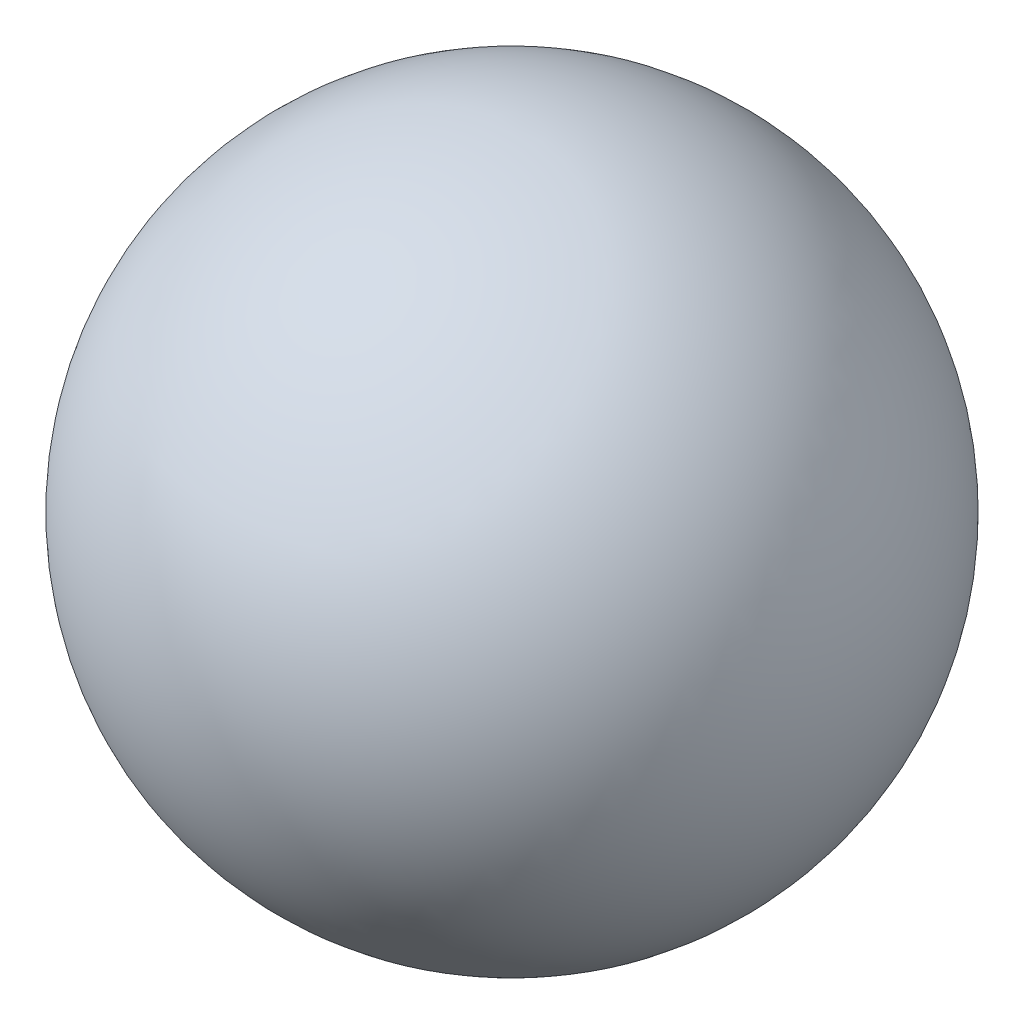
ISO-10303-21;
HEADER;
FILE_DESCRIPTION(('STEP AP214'),'2;1');
FILE_NAME('part.step','',(''),(''),'','','');
FILE_SCHEMA(('AUTOMOTIVE_DESIGN { 1 0 10303 214 1 1 1 1 }'));
ENDSEC;
DATA;
#1=APPLICATION_CONTEXT('core data for automotive mechanical design processes');
#2=APPLICATION_PROTOCOL_DEFINITION('international standard','automotive_design',2000,#1);
#3=PRODUCT_CONTEXT('',#1,'mechanical');
#4=PRODUCT('Part','Part','',(#3));
#5=PRODUCT_RELATED_PRODUCT_CATEGORY('part','',(#4));
#6=PRODUCT_DEFINITION_FORMATION('','',#4);
#7=PRODUCT_DEFINITION_CONTEXT('part definition',#1,'design');
#8=PRODUCT_DEFINITION('design','',#6,#7);
#9=PRODUCT_DEFINITION_SHAPE('','',#8);
#10=(LENGTH_UNIT() NAMED_UNIT(*) SI_UNIT(.MILLI.,.METRE.));
#11=(NAMED_UNIT(*) PLANE_ANGLE_UNIT() SI_UNIT($,.RADIAN.));
#12=(NAMED_UNIT(*) SI_UNIT($,.STERADIAN.) SOLID_ANGLE_UNIT());
#13=UNCERTAINTY_MEASURE_WITH_UNIT(LENGTH_MEASURE(1.E-05),#10,'distance_accuracy_value','');
#14=(GEOMETRIC_REPRESENTATION_CONTEXT(3) GLOBAL_UNCERTAINTY_ASSIGNED_CONTEXT((#13)) GLOBAL_UNIT_ASSIGNED_CONTEXT((#10,
#11,#12)) REPRESENTATION_CONTEXT('',''));
#15=CARTESIAN_POINT('',(0.,0.,0.));
#16=DIRECTION('',(0.,0.,1.));
#17=DIRECTION('',(1.,0.,0.));
#18=AXIS2_PLACEMENT_3D('',#15,#16,#17);
#19=CARTESIAN_POINT('',(0.,19.5,0.));
#20=DIRECTION('',(0.,-1.,0.));
#21=DIRECTION('',(-1.,0.,0.));
#22=AXIS2_PLACEMENT_3D('',#19,#20,#21);
#23=SPHERICAL_SURFACE('',#22,19.5);
#24=CARTESIAN_POINT('',(0.,0.,0.));
#25=VERTEX_POINT('',#24);
#26=VERTEX_LOOP('',#25);
#27=FACE_BOUND('',#26,.T.);
#28=ADVANCED_FACE('F30',(#27),#23,.T.);
#29=CLOSED_SHELL('',(#28));
#30=MANIFOLD_SOLID_BREP('B2',#29);
#31=ADVANCED_BREP_SHAPE_REPRESENTATION('',(#18,#30),#14);
#32=SHAPE_DEFINITION_REPRESENTATION(#9,#31);
ENDSEC;
END-ISO-10303-21;
